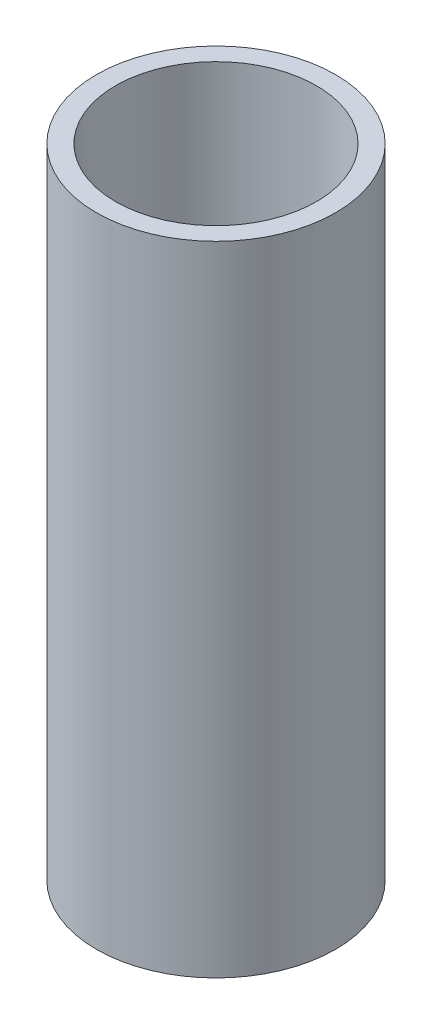
ISO-10303-21;
HEADER;
FILE_DESCRIPTION(('STEP AP214'),'2;1');
FILE_NAME('part.step','',(''),(''),'','','');
FILE_SCHEMA(('AUTOMOTIVE_DESIGN { 1 0 10303 214 1 1 1 1 }'));
ENDSEC;
DATA;
#1=APPLICATION_CONTEXT('core data for automotive mechanical design processes');
#2=APPLICATION_PROTOCOL_DEFINITION('international standard','automotive_design',2000,#1);
#3=PRODUCT_CONTEXT('',#1,'mechanical');
#4=PRODUCT('Part','Part','',(#3));
#5=PRODUCT_RELATED_PRODUCT_CATEGORY('part','',(#4));
#6=PRODUCT_DEFINITION_FORMATION('','',#4);
#7=PRODUCT_DEFINITION_CONTEXT('part definition',#1,'design');
#8=PRODUCT_DEFINITION('design','',#6,#7);
#9=PRODUCT_DEFINITION_SHAPE('','',#8);
#10=(LENGTH_UNIT() NAMED_UNIT(*) SI_UNIT(.MILLI.,.METRE.));
#11=(NAMED_UNIT(*) PLANE_ANGLE_UNIT() SI_UNIT($,.RADIAN.));
#12=(NAMED_UNIT(*) SI_UNIT($,.STERADIAN.) SOLID_ANGLE_UNIT());
#13=UNCERTAINTY_MEASURE_WITH_UNIT(LENGTH_MEASURE(1.E-05),#10,'distance_accuracy_value','');
#14=(GEOMETRIC_REPRESENTATION_CONTEXT(3) GLOBAL_UNCERTAINTY_ASSIGNED_CONTEXT((#13)) GLOBAL_UNIT_ASSIGNED_CONTEXT((#10,
#11,#12)) REPRESENTATION_CONTEXT('',''));
#15=CARTESIAN_POINT('',(0.,0.,0.));
#16=DIRECTION('',(0.,0.,1.));
#17=DIRECTION('',(1.,0.,0.));
#18=AXIS2_PLACEMENT_3D('',#15,#16,#17);
#19=CARTESIAN_POINT('',(0.,50.8,0.));
#20=DIRECTION('',(0.,-1.,0.));
#21=DIRECTION('',(0.,0.,-1.));
#22=AXIS2_PLACEMENT_3D('',#19,#20,#21);
#23=CYLINDRICAL_SURFACE('',#22,9.525);
#24=CARTESIAN_POINT('',(0.,50.8,0.));
#25=DIRECTION('',(0.,1.,0.));
#26=DIRECTION('',(0.,0.,1.));
#27=AXIS2_PLACEMENT_3D('',#24,#25,#26);
#28=CIRCLE('',#27,9.525);
#29=CARTESIAN_POINT('',(0.,50.8,9.525));
#30=VERTEX_POINT('',#29);
#31=EDGE_CURVE('E10',#30,#30,#28,.T.);
#32=ORIENTED_EDGE('',*,*,#31,.F.);
#33=EDGE_LOOP('',(#32));
#34=FACE_BOUND('',#33,.T.);
#35=CARTESIAN_POINT('',(0.,0.,0.));
#36=DIRECTION('',(0.,1.,0.));
#37=DIRECTION('',(0.,0.,1.));
#38=AXIS2_PLACEMENT_3D('',#35,#36,#37);
#39=CIRCLE('',#38,9.525);
#40=CARTESIAN_POINT('',(0.,0.,9.525));
#41=VERTEX_POINT('',#40);
#42=EDGE_CURVE('E38',#41,#41,#39,.T.);
#43=ORIENTED_EDGE('',*,*,#42,.T.);
#44=EDGE_LOOP('',(#43));
#45=FACE_BOUND('',#44,.T.);
#46=ADVANCED_FACE('F31',(#34,#45),#23,.T.);
#47=CARTESIAN_POINT('',(0.,50.8,0.));
#48=DIRECTION('',(0.,1.,0.));
#49=DIRECTION('',(0.,0.,1.));
#50=AXIS2_PLACEMENT_3D('',#47,#48,#49);
#51=PLANE('',#50);
#52=CARTESIAN_POINT('',(0.,50.8,0.));
#53=DIRECTION('',(0.,1.,0.));
#54=DIRECTION('',(0.,0.,1.));
#55=AXIS2_PLACEMENT_3D('',#52,#53,#54);
#56=CIRCLE('',#55,7.99999999999999);
#57=CARTESIAN_POINT('',(0.,50.8,7.99999999999999));
#58=VERTEX_POINT('',#57);
#59=EDGE_CURVE('E47',#58,#58,#56,.T.);
#60=ORIENTED_EDGE('',*,*,#59,.F.);
#61=EDGE_LOOP('',(#60));
#62=FACE_BOUND('',#61,.T.);
#63=ORIENTED_EDGE('',*,*,#31,.T.);
#64=EDGE_LOOP('',(#63));
#65=FACE_BOUND('',#64,.T.);
#66=ADVANCED_FACE('F63',(#62,#65),#51,.T.);
#67=CARTESIAN_POINT('',(0.,0.,0.));
#68=DIRECTION('',(0.,1.,0.));
#69=DIRECTION('',(0.,0.,1.));
#70=AXIS2_PLACEMENT_3D('',#67,#68,#69);
#71=PLANE('',#70);
#72=CARTESIAN_POINT('',(0.,0.,0.));
#73=DIRECTION('',(0.,-1.,0.));
#74=DIRECTION('',(0.,0.,-1.));
#75=AXIS2_PLACEMENT_3D('',#72,#73,#74);
#76=CIRCLE('',#75,4.7625);
#77=CARTESIAN_POINT('',(0.,0.,-4.7625));
#78=VERTEX_POINT('',#77);
#79=EDGE_CURVE('E53',#78,#78,#76,.T.);
#80=ORIENTED_EDGE('',*,*,#79,.F.);
#81=EDGE_LOOP('',(#80));
#82=FACE_BOUND('',#81,.T.);
#83=ORIENTED_EDGE('',*,*,#42,.F.);
#84=EDGE_LOOP('',(#83));
#85=FACE_BOUND('',#84,.T.);
#86=ADVANCED_FACE('F59',(#82,#85),#71,.F.);
#87=CARTESIAN_POINT('',(0.,25.4,0.));
#88=DIRECTION('',(0.,1.,0.));
#89=DIRECTION('',(0.,0.,1.));
#90=AXIS2_PLACEMENT_3D('',#87,#88,#89);
#91=CONICAL_SURFACE('',#90,7.99999999999999,1.02974425867665);
#92=CARTESIAN_POINT('',(0.,20.6173568729491,0.));
#93=DIRECTION('',(0.,-1.,0.));
#94=DIRECTION('',(0.,0.,-1.));
#95=AXIS2_PLACEMENT_3D('',#92,#93,#94);
#96=CIRCLE('',#95,0.0403451722445291);
#97=CARTESIAN_POINT('',(0.,20.6173568729491,-0.0403451722445291));
#98=VERTEX_POINT('',#97);
#99=EDGE_CURVE('E34',#98,#98,#96,.T.);
#100=ORIENTED_EDGE('',*,*,#99,.T.);
#101=EDGE_LOOP('',(#100));
#102=FACE_BOUND('',#101,.T.);
#103=CARTESIAN_POINT('',(0.,25.4,0.));
#104=DIRECTION('',(0.,1.,0.));
#105=DIRECTION('',(0.,0.,1.));
#106=AXIS2_PLACEMENT_3D('',#103,#104,#105);
#107=CIRCLE('',#106,7.99999999999999);
#108=CARTESIAN_POINT('',(0.,25.4,7.99999999999999));
#109=VERTEX_POINT('',#108);
#110=EDGE_CURVE('E43',#109,#109,#107,.T.);
#111=ORIENTED_EDGE('',*,*,#110,.T.);
#112=EDGE_LOOP('',(#111));
#113=FACE_BOUND('',#112,.T.);
#114=ADVANCED_FACE('F62',(#102,#113),#91,.F.);
#115=CARTESIAN_POINT('',(0.,50.8,0.));
#116=DIRECTION('',(0.,1.,0.));
#117=DIRECTION('',(0.,0.,1.));
#118=AXIS2_PLACEMENT_3D('',#115,#116,#117);
#119=CYLINDRICAL_SURFACE('',#118,7.99999999999999);
#120=ORIENTED_EDGE('',*,*,#110,.F.);
#121=EDGE_LOOP('',(#120));
#122=FACE_BOUND('',#121,.T.);
#123=ORIENTED_EDGE('',*,*,#59,.T.);
#124=EDGE_LOOP('',(#123));
#125=FACE_BOUND('',#124,.T.);
#126=ADVANCED_FACE('F79',(#122,#125),#119,.F.);
#127=CARTESIAN_POINT('',(0.,17.78,0.));
#128=DIRECTION('',(0.,-1.,0.));
#129=DIRECTION('',(0.,0.,-1.));
#130=AXIS2_PLACEMENT_3D('',#127,#128,#129);
#131=CONICAL_SURFACE('',#130,4.76249999999999,1.02974425867665);
#132=CARTESIAN_POINT('',(0.,17.78,0.));
#133=DIRECTION('',(0.,-1.,0.));
#134=DIRECTION('',(0.,0.,-1.));
#135=AXIS2_PLACEMENT_3D('',#132,#133,#134);
#136=CIRCLE('',#135,4.76249999999999);
#137=CARTESIAN_POINT('',(0.,17.78,-4.76249999999999));
#138=VERTEX_POINT('',#137);
#139=EDGE_CURVE('E50',#138,#138,#136,.T.);
#140=ORIENTED_EDGE('',*,*,#139,.T.);
#141=EDGE_LOOP('',(#140));
#142=FACE_BOUND('',#141,.T.);
#143=ORIENTED_EDGE('',*,*,#99,.F.);
#144=EDGE_LOOP('',(#143));
#145=FACE_BOUND('',#144,.T.);
#146=ADVANCED_FACE('F83',(#142,#145),#131,.F.);
#147=CARTESIAN_POINT('',(0.,0.,0.));
#148=DIRECTION('',(0.,-1.,0.));
#149=DIRECTION('',(0.,0.,-1.));
#150=AXIS2_PLACEMENT_3D('',#147,#148,#149);
#151=CYLINDRICAL_SURFACE('',#150,4.7625);
#152=ORIENTED_EDGE('',*,*,#139,.F.);
#153=EDGE_LOOP('',(#152));
#154=FACE_BOUND('',#153,.T.);
#155=ORIENTED_EDGE('',*,*,#79,.T.);
#156=EDGE_LOOP('',(#155));
#157=FACE_BOUND('',#156,.T.);
#158=ADVANCED_FACE('F57',(#154,#157),#151,.F.);
#159=CLOSED_SHELL('',(#46,#66,#86,#114,#126,#146,#158));
#160=MANIFOLD_SOLID_BREP('B2',#159);
#161=ADVANCED_BREP_SHAPE_REPRESENTATION('',(#18,#160),#14);
#162=SHAPE_DEFINITION_REPRESENTATION(#9,#161);
ENDSEC;
END-ISO-10303-21;
